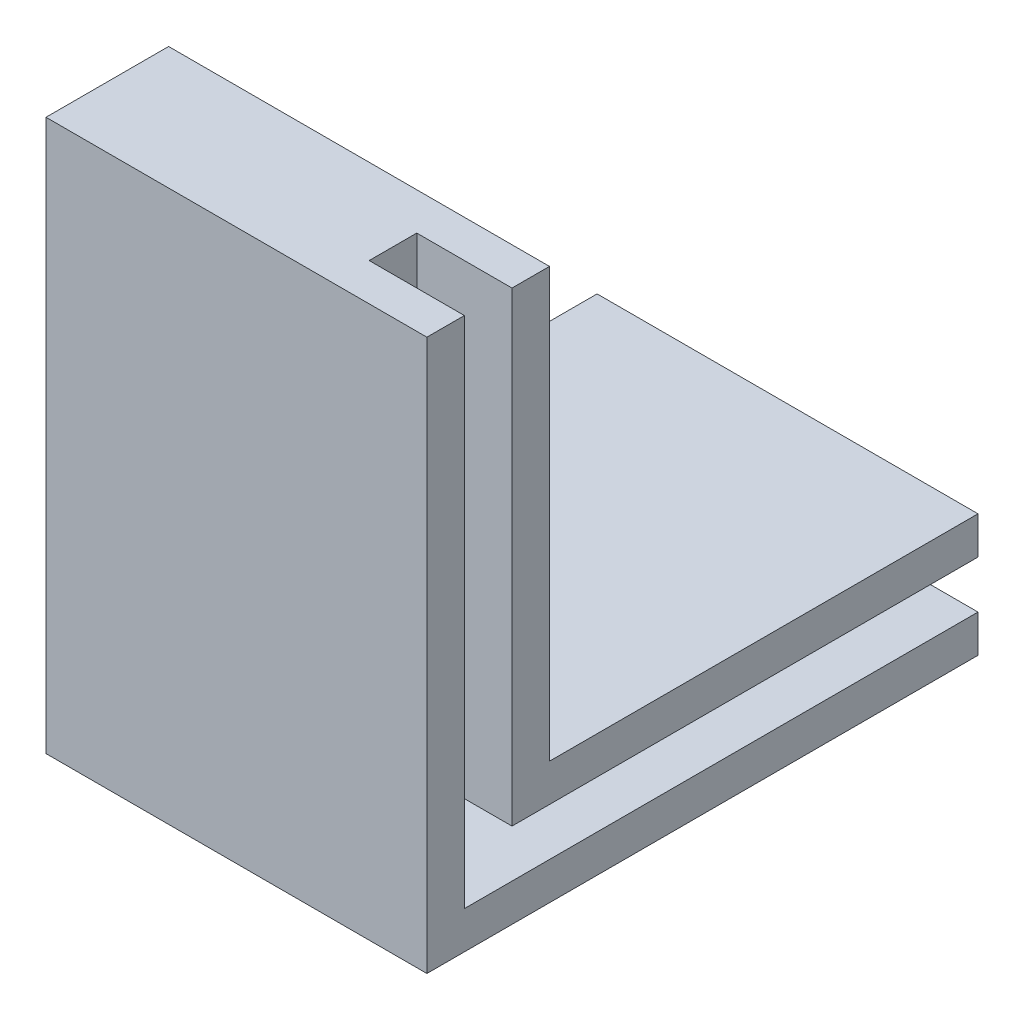
ISO-10303-21;
HEADER;
FILE_DESCRIPTION(('STEP AP214'),'2;1');
FILE_NAME('part.step','',(''),(''),'','','');
FILE_SCHEMA(('AUTOMOTIVE_DESIGN { 1 0 10303 214 1 1 1 1 }'));
ENDSEC;
DATA;
#1=APPLICATION_CONTEXT('core data for automotive mechanical design processes');
#2=APPLICATION_PROTOCOL_DEFINITION('international standard','automotive_design',2000,#1);
#3=PRODUCT_CONTEXT('',#1,'mechanical');
#4=PRODUCT('Part','Part','',(#3));
#5=PRODUCT_RELATED_PRODUCT_CATEGORY('part','',(#4));
#6=PRODUCT_DEFINITION_FORMATION('','',#4);
#7=PRODUCT_DEFINITION_CONTEXT('part definition',#1,'design');
#8=PRODUCT_DEFINITION('design','',#6,#7);
#9=PRODUCT_DEFINITION_SHAPE('','',#8);
#10=(LENGTH_UNIT() NAMED_UNIT(*) SI_UNIT(.MILLI.,.METRE.));
#11=(NAMED_UNIT(*) PLANE_ANGLE_UNIT() SI_UNIT($,.RADIAN.));
#12=(NAMED_UNIT(*) SI_UNIT($,.STERADIAN.) SOLID_ANGLE_UNIT());
#13=UNCERTAINTY_MEASURE_WITH_UNIT(LENGTH_MEASURE(1.E-05),#10,'distance_accuracy_value','');
#14=(GEOMETRIC_REPRESENTATION_CONTEXT(3) GLOBAL_UNCERTAINTY_ASSIGNED_CONTEXT((#13)) GLOBAL_UNIT_ASSIGNED_CONTEXT((#10,
#11,#12)) REPRESENTATION_CONTEXT('',''));
#15=CARTESIAN_POINT('',(0.,0.,0.));
#16=DIRECTION('',(0.,0.,1.));
#17=DIRECTION('',(1.,0.,0.));
#18=AXIS2_PLACEMENT_3D('',#15,#16,#17);
#19=CARTESIAN_POINT('',(50.8,0.,0.));
#20=DIRECTION('',(1.,0.,0.));
#21=DIRECTION('',(0.,0.,-1.));
#22=AXIS2_PLACEMENT_3D('',#19,#20,#21);
#23=PLANE('',#22);
#24=DIRECTION('',(0.,1.,0.));
#25=VECTOR('',#24,1.);
#26=CARTESIAN_POINT('',(50.8,11.35,-11.35));
#27=LINE('',#26,#25);
#28=CARTESIAN_POINT('',(50.8,11.35,-11.35));
#29=VERTEX_POINT('',#28);
#30=CARTESIAN_POINT('',(50.8,73.5,-11.35));
#31=VERTEX_POINT('',#30);
#32=EDGE_CURVE('E171',#29,#31,#27,.T.);
#33=ORIENTED_EDGE('',*,*,#32,.F.);
#34=DIRECTION('',(0.,0.,1.));
#35=VECTOR('',#34,1.);
#36=CARTESIAN_POINT('',(50.8,11.35,-73.5));
#37=LINE('',#36,#35);
#38=CARTESIAN_POINT('',(50.8,11.35,-73.5));
#39=VERTEX_POINT('',#38);
#40=EDGE_CURVE('E219',#39,#29,#37,.T.);
#41=ORIENTED_EDGE('',*,*,#40,.F.);
#42=DIRECTION('',(0.,1.,0.));
#43=VECTOR('',#42,1.);
#44=CARTESIAN_POINT('',(50.8,0.,-73.5));
#45=LINE('',#44,#43);
#46=CARTESIAN_POINT('',(50.8,16.35,-73.5));
#47=VERTEX_POINT('',#46);
#48=EDGE_CURVE('E114',#39,#47,#45,.T.);
#49=ORIENTED_EDGE('',*,*,#48,.T.);
#50=DIRECTION('',(0.,0.,1.));
#51=VECTOR('',#50,1.);
#52=CARTESIAN_POINT('',(50.8,16.35,-73.5));
#53=LINE('',#52,#51);
#54=CARTESIAN_POINT('',(50.8,16.35,-16.35));
#55=VERTEX_POINT('',#54);
#56=EDGE_CURVE('E105',#47,#55,#53,.T.);
#57=ORIENTED_EDGE('',*,*,#56,.T.);
#58=DIRECTION('',(0.,1.,0.));
#59=VECTOR('',#58,1.);
#60=CARTESIAN_POINT('',(50.8,16.35,-16.35));
#61=LINE('',#60,#59);
#62=CARTESIAN_POINT('',(50.8,73.5,-16.35));
#63=VERTEX_POINT('',#62);
#64=EDGE_CURVE('E110',#55,#63,#61,.T.);
#65=ORIENTED_EDGE('',*,*,#64,.T.);
#66=DIRECTION('',(0.,0.,1.));
#67=VECTOR('',#66,1.);
#68=CARTESIAN_POINT('',(50.8,73.5,-16.35));
#69=LINE('',#68,#67);
#70=EDGE_CURVE('E133',#63,#31,#69,.T.);
#71=ORIENTED_EDGE('',*,*,#70,.T.);
#72=EDGE_LOOP('',(#33,#41,#49,#57,#65,#71));
#73=FACE_BOUND('',#72,.T.);
#74=ADVANCED_FACE('F35',(#73),#23,.T.);
#75=CARTESIAN_POINT('',(50.8,73.5,0.));
#76=DIRECTION('',(0.,0.,-1.));
#77=DIRECTION('',(0.,1.,0.));
#78=AXIS2_PLACEMENT_3D('',#75,#76,#77);
#79=PLANE('',#78);
#80=DIRECTION('',(0.,-1.,0.));
#81=VECTOR('',#80,1.);
#82=CARTESIAN_POINT('',(0.,73.5,0.));
#83=LINE('',#82,#81);
#84=CARTESIAN_POINT('',(0.,73.5,0.));
#85=VERTEX_POINT('',#84);
#86=CARTESIAN_POINT('',(0.,0.,0.));
#87=VERTEX_POINT('',#86);
#88=EDGE_CURVE('E138',#85,#87,#83,.T.);
#89=ORIENTED_EDGE('',*,*,#88,.T.);
#90=DIRECTION('',(-1.,0.,0.));
#91=VECTOR('',#90,1.);
#92=CARTESIAN_POINT('',(50.8,0.,0.));
#93=LINE('',#92,#91);
#94=CARTESIAN_POINT('',(50.8,0.,0.));
#95=VERTEX_POINT('',#94);
#96=EDGE_CURVE('E11',#95,#87,#93,.T.);
#97=ORIENTED_EDGE('',*,*,#96,.F.);
#98=DIRECTION('',(0.,-1.,0.));
#99=VECTOR('',#98,1.);
#100=CARTESIAN_POINT('',(50.8,73.5,0.));
#101=LINE('',#100,#99);
#102=CARTESIAN_POINT('',(50.8,73.5,0.));
#103=VERTEX_POINT('',#102);
#104=EDGE_CURVE('E150',#103,#95,#101,.T.);
#105=ORIENTED_EDGE('',*,*,#104,.F.);
#106=DIRECTION('',(-1.,0.,0.));
#107=VECTOR('',#106,1.);
#108=CARTESIAN_POINT('',(50.8,73.5,0.));
#109=LINE('',#108,#107);
#110=EDGE_CURVE('E137',#103,#85,#109,.T.);
#111=ORIENTED_EDGE('',*,*,#110,.T.);
#112=EDGE_LOOP('',(#89,#97,#105,#111));
#113=FACE_BOUND('',#112,.T.);
#114=ADVANCED_FACE('F37',(#113),#79,.F.);
#115=CARTESIAN_POINT('',(50.8,0.,0.));
#116=DIRECTION('',(0.,1.,0.));
#117=DIRECTION('',(0.,0.,1.));
#118=AXIS2_PLACEMENT_3D('',#115,#116,#117);
#119=PLANE('',#118);
#120=DIRECTION('',(0.,0.,-1.));
#121=VECTOR('',#120,1.);
#122=CARTESIAN_POINT('',(0.,0.,0.));
#123=LINE('',#122,#121);
#124=CARTESIAN_POINT('',(0.,0.,-73.5));
#125=VERTEX_POINT('',#124);
#126=EDGE_CURVE('E141',#87,#125,#123,.T.);
#127=ORIENTED_EDGE('',*,*,#126,.T.);
#128=DIRECTION('',(-1.,0.,0.));
#129=VECTOR('',#128,1.);
#130=CARTESIAN_POINT('',(50.8,0.,-73.5));
#131=LINE('',#130,#129);
#132=CARTESIAN_POINT('',(50.8,0.,-73.5));
#133=VERTEX_POINT('',#132);
#134=EDGE_CURVE('E43',#133,#125,#131,.T.);
#135=ORIENTED_EDGE('',*,*,#134,.F.);
#136=DIRECTION('',(0.,0.,-1.));
#137=VECTOR('',#136,1.);
#138=CARTESIAN_POINT('',(50.8,0.,0.));
#139=LINE('',#138,#137);
#140=EDGE_CURVE('E94',#95,#133,#139,.T.);
#141=ORIENTED_EDGE('',*,*,#140,.F.);
#142=ORIENTED_EDGE('',*,*,#96,.T.);
#143=EDGE_LOOP('',(#127,#135,#141,#142));
#144=FACE_BOUND('',#143,.T.);
#145=ADVANCED_FACE('F246',(#144),#119,.F.);
#146=CARTESIAN_POINT('',(50.8,0.,-73.5));
#147=DIRECTION('',(0.,0.,1.));
#148=DIRECTION('',(1.,0.,0.));
#149=AXIS2_PLACEMENT_3D('',#146,#147,#148);
#150=PLANE('',#149);
#151=ORIENTED_EDGE('',*,*,#48,.F.);
#152=DIRECTION('',(1.,0.,0.));
#153=VECTOR('',#152,1.);
#154=CARTESIAN_POINT('',(38.1,11.35,-73.5));
#155=LINE('',#154,#153);
#156=CARTESIAN_POINT('',(38.1,11.35,-73.5));
#157=VERTEX_POINT('',#156);
#158=EDGE_CURVE('E238',#157,#39,#155,.T.);
#159=ORIENTED_EDGE('',*,*,#158,.F.);
#160=DIRECTION('',(0.,1.,0.));
#161=VECTOR('',#160,1.);
#162=CARTESIAN_POINT('',(38.1,5.,-73.5));
#163=LINE('',#162,#161);
#164=CARTESIAN_POINT('',(38.1,5.,-73.5));
#165=VERTEX_POINT('',#164);
#166=EDGE_CURVE('E213',#165,#157,#163,.T.);
#167=ORIENTED_EDGE('',*,*,#166,.F.);
#168=DIRECTION('',(1.,0.,0.));
#169=VECTOR('',#168,1.);
#170=CARTESIAN_POINT('',(38.1,5.,-73.5));
#171=LINE('',#170,#169);
#172=CARTESIAN_POINT('',(50.8,5.,-73.5));
#173=VERTEX_POINT('',#172);
#174=EDGE_CURVE('E204',#165,#173,#171,.T.);
#175=ORIENTED_EDGE('',*,*,#174,.T.);
#176=EDGE_CURVE('E118',#133,#173,#45,.T.);
#177=ORIENTED_EDGE('',*,*,#176,.F.);
#178=ORIENTED_EDGE('',*,*,#134,.T.);
#179=DIRECTION('',(0.,1.,0.));
#180=VECTOR('',#179,1.);
#181=CARTESIAN_POINT('',(0.,0.,-73.5));
#182=LINE('',#181,#180);
#183=CARTESIAN_POINT('',(0.,16.35,-73.5));
#184=VERTEX_POINT('',#183);
#185=EDGE_CURVE('E144',#125,#184,#182,.T.);
#186=ORIENTED_EDGE('',*,*,#185,.T.);
#187=DIRECTION('',(-1.,0.,0.));
#188=VECTOR('',#187,1.);
#189=CARTESIAN_POINT('',(50.8,16.35,-73.5));
#190=LINE('',#189,#188);
#191=EDGE_CURVE('E127',#47,#184,#190,.T.);
#192=ORIENTED_EDGE('',*,*,#191,.F.);
#193=EDGE_LOOP('',(#151,#159,#167,#175,#177,#178,#186,#192));
#194=FACE_BOUND('',#193,.T.);
#195=ADVANCED_FACE('F157',(#194),#150,.F.);
#196=CARTESIAN_POINT('',(50.8,16.35,-73.5));
#197=DIRECTION('',(0.,-1.,0.));
#198=DIRECTION('',(0.,0.,-1.));
#199=AXIS2_PLACEMENT_3D('',#196,#197,#198);
#200=PLANE('',#199);
#201=DIRECTION('',(0.,0.,1.));
#202=VECTOR('',#201,1.);
#203=CARTESIAN_POINT('',(0.,16.35,-73.5));
#204=LINE('',#203,#202);
#205=CARTESIAN_POINT('',(0.,16.35,-16.35));
#206=VERTEX_POINT('',#205);
#207=EDGE_CURVE('E124',#184,#206,#204,.T.);
#208=ORIENTED_EDGE('',*,*,#207,.T.);
#209=DIRECTION('',(-1.,0.,0.));
#210=VECTOR('',#209,1.);
#211=CARTESIAN_POINT('',(50.8,16.35,-16.35));
#212=LINE('',#211,#210);
#213=EDGE_CURVE('E121',#55,#206,#212,.T.);
#214=ORIENTED_EDGE('',*,*,#213,.F.);
#215=ORIENTED_EDGE('',*,*,#56,.F.);
#216=ORIENTED_EDGE('',*,*,#191,.T.);
#217=EDGE_LOOP('',(#208,#214,#215,#216));
#218=FACE_BOUND('',#217,.T.);
#219=ADVANCED_FACE('F122',(#218),#200,.F.);
#220=CARTESIAN_POINT('',(50.8,16.35,-16.35));
#221=DIRECTION('',(0.,0.,1.));
#222=DIRECTION('',(0.,-1.,0.));
#223=AXIS2_PLACEMENT_3D('',#220,#221,#222);
#224=PLANE('',#223);
#225=DIRECTION('',(0.,1.,0.));
#226=VECTOR('',#225,1.);
#227=CARTESIAN_POINT('',(0.,16.35,-16.35));
#228=LINE('',#227,#226);
#229=CARTESIAN_POINT('',(0.,73.5,-16.35));
#230=VERTEX_POINT('',#229);
#231=EDGE_CURVE('E147',#206,#230,#228,.T.);
#232=ORIENTED_EDGE('',*,*,#231,.T.);
#233=DIRECTION('',(-1.,0.,0.));
#234=VECTOR('',#233,1.);
#235=CARTESIAN_POINT('',(50.8,73.5,-16.35));
#236=LINE('',#235,#234);
#237=EDGE_CURVE('E128',#63,#230,#236,.T.);
#238=ORIENTED_EDGE('',*,*,#237,.F.);
#239=ORIENTED_EDGE('',*,*,#64,.F.);
#240=ORIENTED_EDGE('',*,*,#213,.T.);
#241=EDGE_LOOP('',(#232,#238,#239,#240));
#242=FACE_BOUND('',#241,.T.);
#243=ADVANCED_FACE('F130',(#242),#224,.F.);
#244=CARTESIAN_POINT('',(50.8,73.5,-16.35));
#245=DIRECTION('',(0.,-1.,0.));
#246=DIRECTION('',(0.,0.,-1.));
#247=AXIS2_PLACEMENT_3D('',#244,#245,#246);
#248=PLANE('',#247);
#249=CARTESIAN_POINT('',(50.8,73.5,-5.));
#250=VERTEX_POINT('',#249);
#251=EDGE_CURVE('E58',#250,#103,#69,.T.);
#252=ORIENTED_EDGE('',*,*,#251,.F.);
#253=DIRECTION('',(1.,0.,0.));
#254=VECTOR('',#253,1.);
#255=CARTESIAN_POINT('',(38.1,73.5,-5.));
#256=LINE('',#255,#254);
#257=CARTESIAN_POINT('',(38.1,73.5,-5.));
#258=VERTEX_POINT('',#257);
#259=EDGE_CURVE('E142',#258,#250,#256,.T.);
#260=ORIENTED_EDGE('',*,*,#259,.F.);
#261=DIRECTION('',(0.,0.,1.));
#262=VECTOR('',#261,1.);
#263=CARTESIAN_POINT('',(38.1,73.5,-11.35));
#264=LINE('',#263,#262);
#265=CARTESIAN_POINT('',(38.1,73.5,-11.35));
#266=VERTEX_POINT('',#265);
#267=EDGE_CURVE('E205',#266,#258,#264,.T.);
#268=ORIENTED_EDGE('',*,*,#267,.F.);
#269=DIRECTION('',(1.,0.,0.));
#270=VECTOR('',#269,1.);
#271=CARTESIAN_POINT('',(38.1,73.5,-11.35));
#272=LINE('',#271,#270);
#273=EDGE_CURVE('E168',#266,#31,#272,.T.);
#274=ORIENTED_EDGE('',*,*,#273,.T.);
#275=ORIENTED_EDGE('',*,*,#70,.F.);
#276=ORIENTED_EDGE('',*,*,#237,.T.);
#277=DIRECTION('',(0.,0.,1.));
#278=VECTOR('',#277,1.);
#279=CARTESIAN_POINT('',(0.,73.5,-16.35));
#280=LINE('',#279,#278);
#281=EDGE_CURVE('E86',#230,#85,#280,.T.);
#282=ORIENTED_EDGE('',*,*,#281,.T.);
#283=ORIENTED_EDGE('',*,*,#110,.F.);
#284=EDGE_LOOP('',(#252,#260,#268,#274,#275,#276,#282,#283));
#285=FACE_BOUND('',#284,.T.);
#286=ADVANCED_FACE('F163',(#285),#248,.F.);
#287=DIRECTION('',(0.,-1.,0.));
#288=VECTOR('',#287,1.);
#289=CARTESIAN_POINT('',(50.8,73.5,-5.));
#290=LINE('',#289,#288);
#291=CARTESIAN_POINT('',(50.8,5.,-5.00000000000001));
#292=VERTEX_POINT('',#291);
#293=EDGE_CURVE('E50',#250,#292,#290,.T.);
#294=ORIENTED_EDGE('',*,*,#293,.F.);
#295=ORIENTED_EDGE('',*,*,#251,.T.);
#296=ORIENTED_EDGE('',*,*,#104,.T.);
#297=ORIENTED_EDGE('',*,*,#140,.T.);
#298=ORIENTED_EDGE('',*,*,#176,.T.);
#299=DIRECTION('',(0.,0.,-1.));
#300=VECTOR('',#299,1.);
#301=CARTESIAN_POINT('',(50.8,5.,-5.00000000000001));
#302=LINE('',#301,#300);
#303=EDGE_CURVE('E230',#292,#173,#302,.T.);
#304=ORIENTED_EDGE('',*,*,#303,.F.);
#305=EDGE_LOOP('',(#294,#295,#296,#297,#298,#304));
#306=FACE_BOUND('',#305,.T.);
#307=ADVANCED_FACE('F242',(#306),#23,.T.);
#308=CARTESIAN_POINT('',(0.,0.,0.));
#309=DIRECTION('',(1.,0.,0.));
#310=DIRECTION('',(0.,0.,-1.));
#311=AXIS2_PLACEMENT_3D('',#308,#309,#310);
#312=PLANE('',#311);
#313=ORIENTED_EDGE('',*,*,#88,.F.);
#314=ORIENTED_EDGE('',*,*,#281,.F.);
#315=ORIENTED_EDGE('',*,*,#231,.F.);
#316=ORIENTED_EDGE('',*,*,#207,.F.);
#317=ORIENTED_EDGE('',*,*,#185,.F.);
#318=ORIENTED_EDGE('',*,*,#126,.F.);
#319=EDGE_LOOP('',(#313,#314,#315,#316,#317,#318));
#320=FACE_BOUND('',#319,.T.);
#321=ADVANCED_FACE('F162',(#320),#312,.F.);
#322=CARTESIAN_POINT('',(38.1,73.5,-5.));
#323=DIRECTION('',(0.,0.,1.));
#324=DIRECTION('',(0.,-1.,0.));
#325=AXIS2_PLACEMENT_3D('',#322,#323,#324);
#326=PLANE('',#325);
#327=ORIENTED_EDGE('',*,*,#293,.T.);
#328=DIRECTION('',(1.,0.,0.));
#329=VECTOR('',#328,1.);
#330=CARTESIAN_POINT('',(38.1,5.,-5.00000000000001));
#331=LINE('',#330,#329);
#332=CARTESIAN_POINT('',(38.1,5.,-5.00000000000001));
#333=VERTEX_POINT('',#332);
#334=EDGE_CURVE('E196',#333,#292,#331,.T.);
#335=ORIENTED_EDGE('',*,*,#334,.F.);
#336=DIRECTION('',(0.,-1.,0.));
#337=VECTOR('',#336,1.);
#338=CARTESIAN_POINT('',(38.1,73.5,-5.));
#339=LINE('',#338,#337);
#340=EDGE_CURVE('E200',#258,#333,#339,.T.);
#341=ORIENTED_EDGE('',*,*,#340,.F.);
#342=ORIENTED_EDGE('',*,*,#259,.T.);
#343=EDGE_LOOP('',(#327,#335,#341,#342));
#344=FACE_BOUND('',#343,.T.);
#345=ADVANCED_FACE('F198',(#344),#326,.F.);
#346=CARTESIAN_POINT('',(38.1,11.35,-11.35));
#347=DIRECTION('',(0.,0.,-1.));
#348=DIRECTION('',(-1.,0.,0.));
#349=AXIS2_PLACEMENT_3D('',#346,#347,#348);
#350=PLANE('',#349);
#351=ORIENTED_EDGE('',*,*,#32,.T.);
#352=ORIENTED_EDGE('',*,*,#273,.F.);
#353=DIRECTION('',(0.,1.,0.));
#354=VECTOR('',#353,1.);
#355=CARTESIAN_POINT('',(38.1,11.35,-11.35));
#356=LINE('',#355,#354);
#357=CARTESIAN_POINT('',(38.1,11.35,-11.35));
#358=VERTEX_POINT('',#357);
#359=EDGE_CURVE('E226',#358,#266,#356,.T.);
#360=ORIENTED_EDGE('',*,*,#359,.F.);
#361=DIRECTION('',(1.,0.,0.));
#362=VECTOR('',#361,1.);
#363=CARTESIAN_POINT('',(38.1,11.35,-11.35));
#364=LINE('',#363,#362);
#365=EDGE_CURVE('E236',#358,#29,#364,.T.);
#366=ORIENTED_EDGE('',*,*,#365,.T.);
#367=EDGE_LOOP('',(#351,#352,#360,#366));
#368=FACE_BOUND('',#367,.T.);
#369=ADVANCED_FACE('F311',(#368),#350,.F.);
#370=CARTESIAN_POINT('',(38.1,11.35,-73.5));
#371=DIRECTION('',(0.,1.,0.));
#372=DIRECTION('',(0.,0.,1.));
#373=AXIS2_PLACEMENT_3D('',#370,#371,#372);
#374=PLANE('',#373);
#375=ORIENTED_EDGE('',*,*,#40,.T.);
#376=ORIENTED_EDGE('',*,*,#365,.F.);
#377=DIRECTION('',(0.,0.,1.));
#378=VECTOR('',#377,1.);
#379=CARTESIAN_POINT('',(38.1,11.35,-73.5));
#380=LINE('',#379,#378);
#381=EDGE_CURVE('E223',#157,#358,#380,.T.);
#382=ORIENTED_EDGE('',*,*,#381,.F.);
#383=ORIENTED_EDGE('',*,*,#158,.T.);
#384=EDGE_LOOP('',(#375,#376,#382,#383));
#385=FACE_BOUND('',#384,.T.);
#386=ADVANCED_FACE('F319',(#385),#374,.F.);
#387=CARTESIAN_POINT('',(38.1,5.,-5.00000000000001));
#388=DIRECTION('',(0.,-1.,0.));
#389=DIRECTION('',(0.,0.,-1.));
#390=AXIS2_PLACEMENT_3D('',#387,#388,#389);
#391=PLANE('',#390);
#392=ORIENTED_EDGE('',*,*,#303,.T.);
#393=ORIENTED_EDGE('',*,*,#174,.F.);
#394=DIRECTION('',(0.,0.,-1.));
#395=VECTOR('',#394,1.);
#396=CARTESIAN_POINT('',(38.1,5.,-5.00000000000001));
#397=LINE('',#396,#395);
#398=EDGE_CURVE('E208',#333,#165,#397,.T.);
#399=ORIENTED_EDGE('',*,*,#398,.F.);
#400=ORIENTED_EDGE('',*,*,#334,.T.);
#401=EDGE_LOOP('',(#392,#393,#399,#400));
#402=FACE_BOUND('',#401,.T.);
#403=ADVANCED_FACE('F209',(#402),#391,.F.);
#404=CARTESIAN_POINT('',(38.1,0.,0.));
#405=DIRECTION('',(1.,0.,0.));
#406=DIRECTION('',(0.,0.,-1.));
#407=AXIS2_PLACEMENT_3D('',#404,#405,#406);
#408=PLANE('',#407);
#409=ORIENTED_EDGE('',*,*,#340,.T.);
#410=ORIENTED_EDGE('',*,*,#398,.T.);
#411=ORIENTED_EDGE('',*,*,#166,.T.);
#412=ORIENTED_EDGE('',*,*,#381,.T.);
#413=ORIENTED_EDGE('',*,*,#359,.T.);
#414=ORIENTED_EDGE('',*,*,#267,.T.);
#415=EDGE_LOOP('',(#409,#410,#411,#412,#413,#414));
#416=FACE_BOUND('',#415,.T.);
#417=ADVANCED_FACE('F215',(#416),#408,.T.);
#418=CLOSED_SHELL('',(#74,#114,#145,#195,#219,#243,#286,#307,#321,#345,#369,#386,#403,#417));
#419=MANIFOLD_SOLID_BREP('B2',#418);
#420=ADVANCED_BREP_SHAPE_REPRESENTATION('',(#18,#419),#14);
#421=SHAPE_DEFINITION_REPRESENTATION(#9,#420);
ENDSEC;
END-ISO-10303-21;
